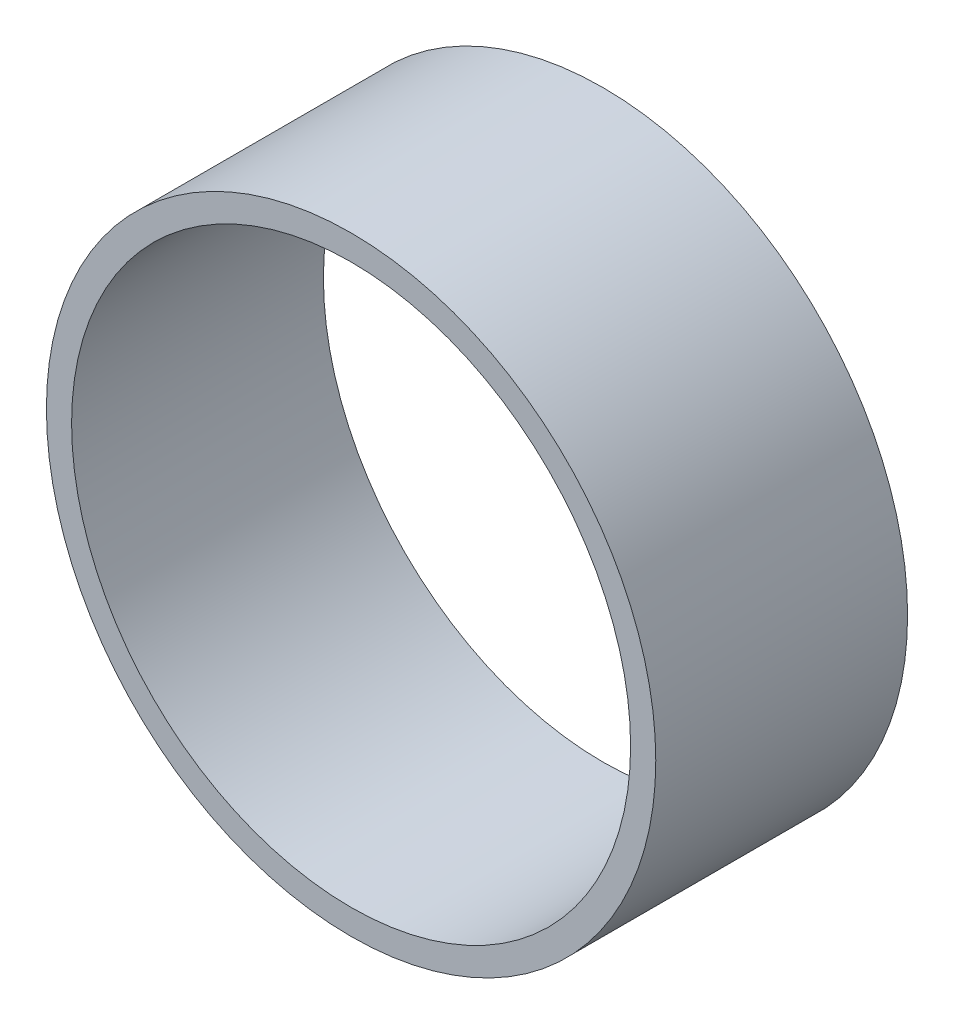
ISO-10303-21;
HEADER;
FILE_DESCRIPTION(('STEP AP214'),'2;1');
FILE_NAME('part.step','',(''),(''),'','','');
FILE_SCHEMA(('AUTOMOTIVE_DESIGN { 1 0 10303 214 1 1 1 1 }'));
ENDSEC;
DATA;
#1=APPLICATION_CONTEXT('core data for automotive mechanical design processes');
#2=APPLICATION_PROTOCOL_DEFINITION('international standard','automotive_design',2000,#1);
#3=PRODUCT_CONTEXT('',#1,'mechanical');
#4=PRODUCT('Part','Part','',(#3));
#5=PRODUCT_RELATED_PRODUCT_CATEGORY('part','',(#4));
#6=PRODUCT_DEFINITION_FORMATION('','',#4);
#7=PRODUCT_DEFINITION_CONTEXT('part definition',#1,'design');
#8=PRODUCT_DEFINITION('design','',#6,#7);
#9=PRODUCT_DEFINITION_SHAPE('','',#8);
#10=(LENGTH_UNIT() NAMED_UNIT(*) SI_UNIT(.MILLI.,.METRE.));
#11=(NAMED_UNIT(*) PLANE_ANGLE_UNIT() SI_UNIT($,.RADIAN.));
#12=(NAMED_UNIT(*) SI_UNIT($,.STERADIAN.) SOLID_ANGLE_UNIT());
#13=UNCERTAINTY_MEASURE_WITH_UNIT(LENGTH_MEASURE(1.E-05),#10,'distance_accuracy_value','');
#14=(GEOMETRIC_REPRESENTATION_CONTEXT(3) GLOBAL_UNCERTAINTY_ASSIGNED_CONTEXT((#13)) GLOBAL_UNIT_ASSIGNED_CONTEXT((#10,
#11,#12)) REPRESENTATION_CONTEXT('',''));
#15=CARTESIAN_POINT('',(0.,0.,0.));
#16=DIRECTION('',(0.,0.,1.));
#17=DIRECTION('',(1.,0.,0.));
#18=AXIS2_PLACEMENT_3D('',#15,#16,#17);
#19=CARTESIAN_POINT('',(0.,0.,10.));
#20=DIRECTION('',(0.,0.,1.));
#21=DIRECTION('',(1.,0.,0.));
#22=AXIS2_PLACEMENT_3D('',#19,#20,#21);
#23=PLANE('',#22);
#24=CARTESIAN_POINT('',(0.,0.,10.));
#25=DIRECTION('',(0.,0.,1.));
#26=DIRECTION('',(1.,0.,0.));
#27=AXIS2_PLACEMENT_3D('',#24,#25,#26);
#28=CIRCLE('',#27,12.1);
#29=CARTESIAN_POINT('',(12.1,0.,10.));
#30=VERTEX_POINT('',#29);
#31=EDGE_CURVE('E10',#30,#30,#28,.T.);
#32=ORIENTED_EDGE('',*,*,#31,.T.);
#33=EDGE_LOOP('',(#32));
#34=FACE_BOUND('',#33,.T.);
#35=CARTESIAN_POINT('',(0.,0.,10.));
#36=DIRECTION('',(0.,0.,1.));
#37=DIRECTION('',(1.,0.,0.));
#38=AXIS2_PLACEMENT_3D('',#35,#36,#37);
#39=CIRCLE('',#38,11.1);
#40=CARTESIAN_POINT('',(11.1,0.,10.));
#41=VERTEX_POINT('',#40);
#42=EDGE_CURVE('E50',#41,#41,#39,.T.);
#43=ORIENTED_EDGE('',*,*,#42,.F.);
#44=EDGE_LOOP('',(#43));
#45=FACE_BOUND('',#44,.T.);
#46=ADVANCED_FACE('F37',(#34,#45),#23,.T.);
#47=CARTESIAN_POINT('',(0.,0.,0.));
#48=DIRECTION('',(0.,0.,1.));
#49=DIRECTION('',(1.,0.,0.));
#50=AXIS2_PLACEMENT_3D('',#47,#48,#49);
#51=PLANE('',#50);
#52=CARTESIAN_POINT('',(0.,0.,0.));
#53=DIRECTION('',(0.,0.,1.));
#54=DIRECTION('',(1.,0.,0.));
#55=AXIS2_PLACEMENT_3D('',#52,#53,#54);
#56=CIRCLE('',#55,12.1);
#57=CARTESIAN_POINT('',(12.1,0.,0.));
#58=VERTEX_POINT('',#57);
#59=EDGE_CURVE('E41',#58,#58,#56,.T.);
#60=ORIENTED_EDGE('',*,*,#59,.F.);
#61=EDGE_LOOP('',(#60));
#62=FACE_BOUND('',#61,.T.);
#63=CARTESIAN_POINT('',(0.,0.,0.));
#64=DIRECTION('',(0.,0.,1.));
#65=DIRECTION('',(1.,0.,0.));
#66=AXIS2_PLACEMENT_3D('',#63,#64,#65);
#67=CIRCLE('',#66,11.1);
#68=CARTESIAN_POINT('',(11.1,0.,0.));
#69=VERTEX_POINT('',#68);
#70=EDGE_CURVE('E52',#69,#69,#67,.T.);
#71=ORIENTED_EDGE('',*,*,#70,.T.);
#72=EDGE_LOOP('',(#71));
#73=FACE_BOUND('',#72,.T.);
#74=ADVANCED_FACE('F64',(#62,#73),#51,.F.);
#75=CARTESIAN_POINT('',(0.,0.,10.));
#76=DIRECTION('',(0.,0.,-1.));
#77=DIRECTION('',(-1.,0.,0.));
#78=AXIS2_PLACEMENT_3D('',#75,#76,#77);
#79=CYLINDRICAL_SURFACE('',#78,12.1);
#80=ORIENTED_EDGE('',*,*,#31,.F.);
#81=EDGE_LOOP('',(#80));
#82=FACE_BOUND('',#81,.T.);
#83=ORIENTED_EDGE('',*,*,#59,.T.);
#84=EDGE_LOOP('',(#83));
#85=FACE_BOUND('',#84,.T.);
#86=ADVANCED_FACE('F39',(#82,#85),#79,.T.);
#87=CARTESIAN_POINT('',(0.,0.,10.));
#88=DIRECTION('',(0.,0.,-1.));
#89=DIRECTION('',(-1.,0.,0.));
#90=AXIS2_PLACEMENT_3D('',#87,#88,#89);
#91=CYLINDRICAL_SURFACE('',#90,11.1);
#92=ORIENTED_EDGE('',*,*,#42,.T.);
#93=EDGE_LOOP('',(#92));
#94=FACE_BOUND('',#93,.T.);
#95=ORIENTED_EDGE('',*,*,#70,.F.);
#96=EDGE_LOOP('',(#95));
#97=FACE_BOUND('',#96,.T.);
#98=ADVANCED_FACE('F60',(#94,#97),#91,.F.);
#99=CLOSED_SHELL('',(#46,#74,#86,#98));
#100=MANIFOLD_SOLID_BREP('B2',#99);
#101=ADVANCED_BREP_SHAPE_REPRESENTATION('',(#18,#100),#14);
#102=SHAPE_DEFINITION_REPRESENTATION(#9,#101);
ENDSEC;
END-ISO-10303-21;
